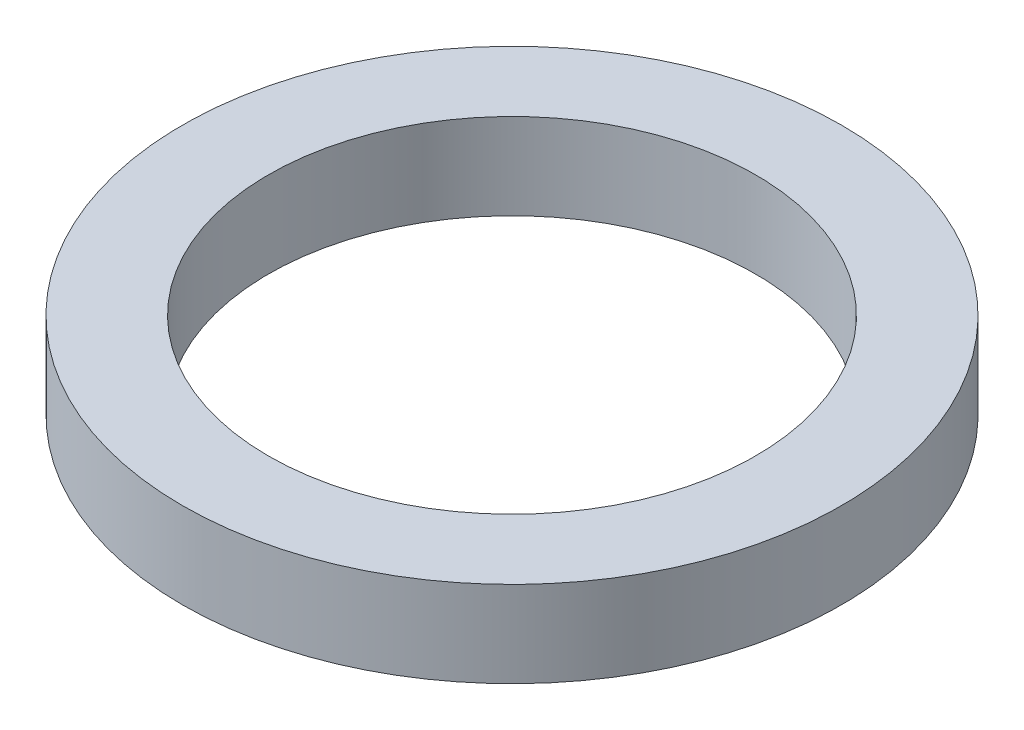
ISO-10303-21;
HEADER;
FILE_DESCRIPTION(('STEP AP214'),'2;1');
FILE_NAME('part.step','',(''),(''),'','','');
FILE_SCHEMA(('AUTOMOTIVE_DESIGN { 1 0 10303 214 1 1 1 1 }'));
ENDSEC;
DATA;
#1=APPLICATION_CONTEXT('core data for automotive mechanical design processes');
#2=APPLICATION_PROTOCOL_DEFINITION('international standard','automotive_design',2000,#1);
#3=PRODUCT_CONTEXT('',#1,'mechanical');
#4=PRODUCT('Part','Part','',(#3));
#5=PRODUCT_RELATED_PRODUCT_CATEGORY('part','',(#4));
#6=PRODUCT_DEFINITION_FORMATION('','',#4);
#7=PRODUCT_DEFINITION_CONTEXT('part definition',#1,'design');
#8=PRODUCT_DEFINITION('design','',#6,#7);
#9=PRODUCT_DEFINITION_SHAPE('','',#8);
#10=(LENGTH_UNIT() NAMED_UNIT(*) SI_UNIT(.MILLI.,.METRE.));
#11=(NAMED_UNIT(*) PLANE_ANGLE_UNIT() SI_UNIT($,.RADIAN.));
#12=(NAMED_UNIT(*) SI_UNIT($,.STERADIAN.) SOLID_ANGLE_UNIT());
#13=UNCERTAINTY_MEASURE_WITH_UNIT(LENGTH_MEASURE(1.E-05),#10,'distance_accuracy_value','');
#14=(GEOMETRIC_REPRESENTATION_CONTEXT(3) GLOBAL_UNCERTAINTY_ASSIGNED_CONTEXT((#13)) GLOBAL_UNIT_ASSIGNED_CONTEXT((#10,
#11,#12)) REPRESENTATION_CONTEXT('',''));
#15=CARTESIAN_POINT('',(0.,0.,0.));
#16=DIRECTION('',(0.,0.,1.));
#17=DIRECTION('',(1.,0.,0.));
#18=AXIS2_PLACEMENT_3D('',#15,#16,#17);
#19=CARTESIAN_POINT('',(0.,15.,0.));
#20=DIRECTION('',(0.,-1.,0.));
#21=DIRECTION('',(0.,0.,-1.));
#22=AXIS2_PLACEMENT_3D('',#19,#20,#21);
#23=CYLINDRICAL_SURFACE('',#22,57.5);
#24=CARTESIAN_POINT('',(0.,15.,0.));
#25=DIRECTION('',(0.,1.,0.));
#26=DIRECTION('',(0.,0.,1.));
#27=AXIS2_PLACEMENT_3D('',#24,#25,#26);
#28=CIRCLE('',#27,57.5);
#29=CARTESIAN_POINT('',(0.,15.,57.5));
#30=VERTEX_POINT('',#29);
#31=EDGE_CURVE('E10',#30,#30,#28,.T.);
#32=ORIENTED_EDGE('',*,*,#31,.F.);
#33=EDGE_LOOP('',(#32));
#34=FACE_BOUND('',#33,.T.);
#35=CARTESIAN_POINT('',(0.,0.,0.));
#36=DIRECTION('',(0.,1.,0.));
#37=DIRECTION('',(0.,0.,1.));
#38=AXIS2_PLACEMENT_3D('',#35,#36,#37);
#39=CIRCLE('',#38,57.5);
#40=CARTESIAN_POINT('',(0.,0.,57.5));
#41=VERTEX_POINT('',#40);
#42=EDGE_CURVE('E37',#41,#41,#39,.T.);
#43=ORIENTED_EDGE('',*,*,#42,.T.);
#44=EDGE_LOOP('',(#43));
#45=FACE_BOUND('',#44,.T.);
#46=ADVANCED_FACE('F40',(#34,#45),#23,.T.);
#47=CARTESIAN_POINT('',(0.,15.,0.));
#48=DIRECTION('',(0.,1.,0.));
#49=DIRECTION('',(0.,0.,1.));
#50=AXIS2_PLACEMENT_3D('',#47,#48,#49);
#51=PLANE('',#50);
#52=CARTESIAN_POINT('',(0.,15.,0.));
#53=DIRECTION('',(0.,1.,0.));
#54=DIRECTION('',(0.,0.,1.));
#55=AXIS2_PLACEMENT_3D('',#52,#53,#54);
#56=CIRCLE('',#55,42.5);
#57=CARTESIAN_POINT('',(0.,15.,42.5));
#58=VERTEX_POINT('',#57);
#59=EDGE_CURVE('E50',#58,#58,#56,.T.);
#60=ORIENTED_EDGE('',*,*,#59,.F.);
#61=EDGE_LOOP('',(#60));
#62=FACE_BOUND('',#61,.T.);
#63=ORIENTED_EDGE('',*,*,#31,.T.);
#64=EDGE_LOOP('',(#63));
#65=FACE_BOUND('',#64,.T.);
#66=ADVANCED_FACE('F59',(#62,#65),#51,.T.);
#67=CARTESIAN_POINT('',(0.,0.,0.));
#68=DIRECTION('',(0.,1.,0.));
#69=DIRECTION('',(0.,0.,1.));
#70=AXIS2_PLACEMENT_3D('',#67,#68,#69);
#71=PLANE('',#70);
#72=CARTESIAN_POINT('',(0.,0.,0.));
#73=DIRECTION('',(0.,1.,0.));
#74=DIRECTION('',(0.,0.,1.));
#75=AXIS2_PLACEMENT_3D('',#72,#73,#74);
#76=CIRCLE('',#75,42.5);
#77=CARTESIAN_POINT('',(0.,0.,42.5));
#78=VERTEX_POINT('',#77);
#79=EDGE_CURVE('E47',#78,#78,#76,.T.);
#80=ORIENTED_EDGE('',*,*,#79,.T.);
#81=EDGE_LOOP('',(#80));
#82=FACE_BOUND('',#81,.T.);
#83=ORIENTED_EDGE('',*,*,#42,.F.);
#84=EDGE_LOOP('',(#83));
#85=FACE_BOUND('',#84,.T.);
#86=ADVANCED_FACE('F58',(#82,#85),#71,.F.);
#87=CARTESIAN_POINT('',(0.,15.,0.));
#88=DIRECTION('',(0.,-1.,0.));
#89=DIRECTION('',(0.,0.,-1.));
#90=AXIS2_PLACEMENT_3D('',#87,#88,#89);
#91=CYLINDRICAL_SURFACE('',#90,42.5);
#92=ORIENTED_EDGE('',*,*,#59,.T.);
#93=EDGE_LOOP('',(#92));
#94=FACE_BOUND('',#93,.T.);
#95=ORIENTED_EDGE('',*,*,#79,.F.);
#96=EDGE_LOOP('',(#95));
#97=FACE_BOUND('',#96,.T.);
#98=ADVANCED_FACE('F54',(#94,#97),#91,.F.);
#99=CLOSED_SHELL('',(#46,#66,#86,#98));
#100=MANIFOLD_SOLID_BREP('B2',#99);
#101=ADVANCED_BREP_SHAPE_REPRESENTATION('',(#18,#100),#14);
#102=SHAPE_DEFINITION_REPRESENTATION(#9,#101);
ENDSEC;
END-ISO-10303-21;
